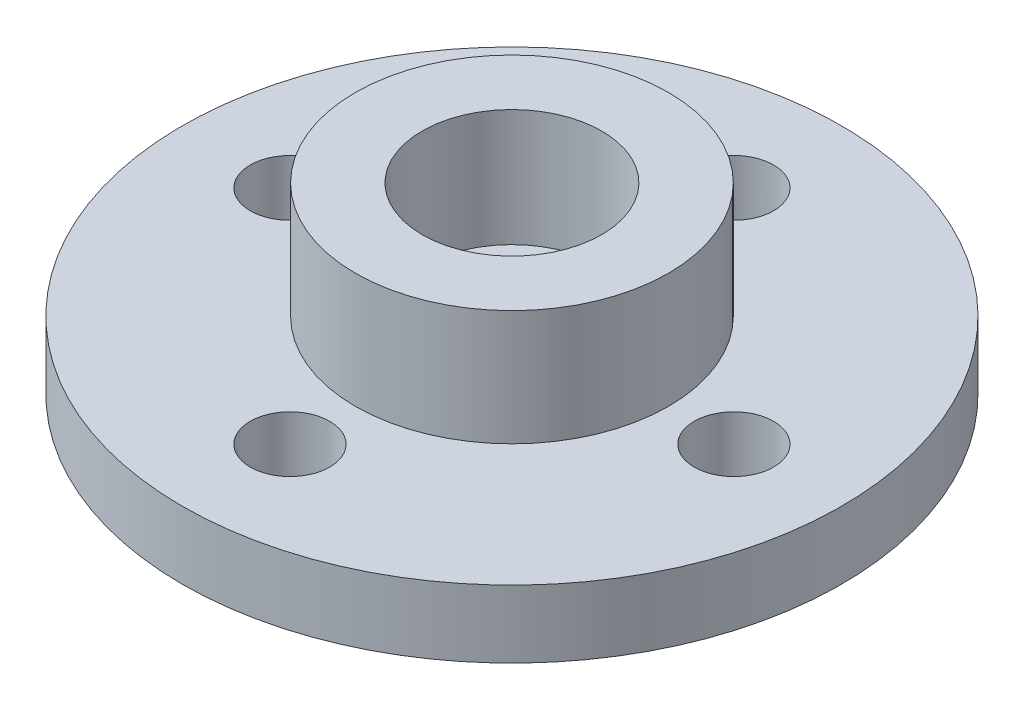
ISO-10303-21;
HEADER;
FILE_DESCRIPTION(('STEP AP214'),'2;1');
FILE_NAME('part.step','',(''),(''),'','','');
FILE_SCHEMA(('AUTOMOTIVE_DESIGN { 1 0 10303 214 1 1 1 1 }'));
ENDSEC;
DATA;
#1=APPLICATION_CONTEXT('core data for automotive mechanical design processes');
#2=APPLICATION_PROTOCOL_DEFINITION('international standard','automotive_design',2000,#1);
#3=PRODUCT_CONTEXT('',#1,'mechanical');
#4=PRODUCT('Part','Part','',(#3));
#5=PRODUCT_RELATED_PRODUCT_CATEGORY('part','',(#4));
#6=PRODUCT_DEFINITION_FORMATION('','',#4);
#7=PRODUCT_DEFINITION_CONTEXT('part definition',#1,'design');
#8=PRODUCT_DEFINITION('design','',#6,#7);
#9=PRODUCT_DEFINITION_SHAPE('','',#8);
#10=(LENGTH_UNIT() NAMED_UNIT(*) SI_UNIT(.MILLI.,.METRE.));
#11=(NAMED_UNIT(*) PLANE_ANGLE_UNIT() SI_UNIT($,.RADIAN.));
#12=(NAMED_UNIT(*) SI_UNIT($,.STERADIAN.) SOLID_ANGLE_UNIT());
#13=UNCERTAINTY_MEASURE_WITH_UNIT(LENGTH_MEASURE(1.E-05),#10,'distance_accuracy_value','');
#14=(GEOMETRIC_REPRESENTATION_CONTEXT(3) GLOBAL_UNCERTAINTY_ASSIGNED_CONTEXT((#13)) GLOBAL_UNIT_ASSIGNED_CONTEXT((#10,
#11,#12)) REPRESENTATION_CONTEXT('',''));
#15=CARTESIAN_POINT('',(0.,0.,0.));
#16=DIRECTION('',(0.,0.,1.));
#17=DIRECTION('',(1.,0.,0.));
#18=AXIS2_PLACEMENT_3D('',#15,#16,#17);
#19=CARTESIAN_POINT('',(0.,2.05,0.));
#20=DIRECTION('',(0.,-1.,0.));
#21=DIRECTION('',(0.,0.,-1.));
#22=AXIS2_PLACEMENT_3D('',#19,#20,#21);
#23=CYLINDRICAL_SURFACE('',#22,10.);
#24=CARTESIAN_POINT('',(0.,2.05,0.));
#25=DIRECTION('',(0.,1.,0.));
#26=DIRECTION('',(0.,0.,1.));
#27=AXIS2_PLACEMENT_3D('',#24,#25,#26);
#28=CIRCLE('',#27,10.);
#29=CARTESIAN_POINT('',(0.,2.05,10.));
#30=VERTEX_POINT('',#29);
#31=EDGE_CURVE('E12',#30,#30,#28,.T.);
#32=ORIENTED_EDGE('',*,*,#31,.F.);
#33=EDGE_LOOP('',(#32));
#34=FACE_BOUND('',#33,.T.);
#35=CARTESIAN_POINT('',(0.,0.,0.));
#36=DIRECTION('',(0.,1.,0.));
#37=DIRECTION('',(0.,0.,1.));
#38=AXIS2_PLACEMENT_3D('',#35,#36,#37);
#39=CIRCLE('',#38,10.);
#40=CARTESIAN_POINT('',(0.,0.,10.));
#41=VERTEX_POINT('',#40);
#42=EDGE_CURVE('E47',#41,#41,#39,.T.);
#43=ORIENTED_EDGE('',*,*,#42,.T.);
#44=EDGE_LOOP('',(#43));
#45=FACE_BOUND('',#44,.T.);
#46=ADVANCED_FACE('F44',(#34,#45),#23,.T.);
#47=CARTESIAN_POINT('',(0.,2.05,0.));
#48=DIRECTION('',(0.,1.,0.));
#49=DIRECTION('',(0.,0.,1.));
#50=AXIS2_PLACEMENT_3D('',#47,#48,#49);
#51=PLANE('',#50);
#52=CARTESIAN_POINT('',(6.735,2.05,0.));
#53=DIRECTION('',(0.,1.,0.));
#54=DIRECTION('',(0.,0.,1.));
#55=AXIS2_PLACEMENT_3D('',#52,#53,#54);
#56=CIRCLE('',#55,1.205);
#57=CARTESIAN_POINT('',(6.735,2.05,1.205));
#58=VERTEX_POINT('',#57);
#59=EDGE_CURVE('E85',#58,#58,#56,.T.);
#60=ORIENTED_EDGE('',*,*,#59,.F.);
#61=EDGE_LOOP('',(#60));
#62=FACE_BOUND('',#61,.T.);
#63=CARTESIAN_POINT('',(0.,2.05,-6.735));
#64=DIRECTION('',(0.,1.,0.));
#65=DIRECTION('',(0.,0.,1.));
#66=AXIS2_PLACEMENT_3D('',#63,#64,#65);
#67=CIRCLE('',#66,1.205);
#68=CARTESIAN_POINT('',(0.,2.05,-5.53));
#69=VERTEX_POINT('',#68);
#70=EDGE_CURVE('E88',#69,#69,#67,.T.);
#71=ORIENTED_EDGE('',*,*,#70,.F.);
#72=EDGE_LOOP('',(#71));
#73=FACE_BOUND('',#72,.T.);
#74=CARTESIAN_POINT('',(0.,2.05,6.735));
#75=DIRECTION('',(0.,1.,0.));
#76=DIRECTION('',(0.,0.,1.));
#77=AXIS2_PLACEMENT_3D('',#74,#75,#76);
#78=CIRCLE('',#77,1.205);
#79=CARTESIAN_POINT('',(0.,2.05,7.94));
#80=VERTEX_POINT('',#79);
#81=EDGE_CURVE('E79',#80,#80,#78,.T.);
#82=ORIENTED_EDGE('',*,*,#81,.F.);
#83=EDGE_LOOP('',(#82));
#84=FACE_BOUND('',#83,.T.);
#85=CARTESIAN_POINT('',(-6.735,2.05,0.));
#86=DIRECTION('',(0.,1.,0.));
#87=DIRECTION('',(0.,0.,1.));
#88=AXIS2_PLACEMENT_3D('',#85,#86,#87);
#89=CIRCLE('',#88,1.205);
#90=CARTESIAN_POINT('',(-6.735,2.05,1.205));
#91=VERTEX_POINT('',#90);
#92=EDGE_CURVE('E73',#91,#91,#89,.T.);
#93=ORIENTED_EDGE('',*,*,#92,.F.);
#94=EDGE_LOOP('',(#93));
#95=FACE_BOUND('',#94,.T.);
#96=CARTESIAN_POINT('',(0.,2.05,0.));
#97=DIRECTION('',(0.,1.,0.));
#98=DIRECTION('',(0.,0.,1.));
#99=AXIS2_PLACEMENT_3D('',#96,#97,#98);
#100=CIRCLE('',#99,4.75);
#101=CARTESIAN_POINT('',(0.,2.05,4.75));
#102=VERTEX_POINT('',#101);
#103=EDGE_CURVE('E56',#102,#102,#100,.T.);
#104=ORIENTED_EDGE('',*,*,#103,.F.);
#105=EDGE_LOOP('',(#104));
#106=FACE_BOUND('',#105,.T.);
#107=ORIENTED_EDGE('',*,*,#31,.T.);
#108=EDGE_LOOP('',(#107));
#109=FACE_BOUND('',#108,.T.);
#110=ADVANCED_FACE('F104',(#62,#73,#84,#95,#106,#109),#51,.T.);
#111=CARTESIAN_POINT('',(0.,0.,0.));
#112=DIRECTION('',(0.,1.,0.));
#113=DIRECTION('',(0.,0.,1.));
#114=AXIS2_PLACEMENT_3D('',#111,#112,#113);
#115=PLANE('',#114);
#116=CARTESIAN_POINT('',(6.735,0.,0.));
#117=DIRECTION('',(0.,-1.,0.));
#118=DIRECTION('',(0.,0.,1.));
#119=AXIS2_PLACEMENT_3D('',#116,#117,#118);
#120=CIRCLE('',#119,1.205);
#121=CARTESIAN_POINT('',(6.735,0.,1.205));
#122=VERTEX_POINT('',#121);
#123=EDGE_CURVE('E91',#122,#122,#120,.T.);
#124=ORIENTED_EDGE('',*,*,#123,.F.);
#125=EDGE_LOOP('',(#124));
#126=FACE_BOUND('',#125,.T.);
#127=CARTESIAN_POINT('',(0.,0.,-6.735));
#128=DIRECTION('',(0.,-1.,0.));
#129=DIRECTION('',(1.,0.,0.));
#130=AXIS2_PLACEMENT_3D('',#127,#128,#129);
#131=CIRCLE('',#130,1.205);
#132=CARTESIAN_POINT('',(1.20499999999993,0.,-6.73500000000001));
#133=VERTEX_POINT('',#132);
#134=EDGE_CURVE('E92',#133,#133,#131,.T.);
#135=ORIENTED_EDGE('',*,*,#134,.F.);
#136=EDGE_LOOP('',(#135));
#137=FACE_BOUND('',#136,.T.);
#138=CARTESIAN_POINT('',(0.,0.,6.735));
#139=DIRECTION('',(0.,-1.,0.));
#140=DIRECTION('',(-1.,0.,0.));
#141=AXIS2_PLACEMENT_3D('',#138,#139,#140);
#142=CIRCLE('',#141,1.205);
#143=CARTESIAN_POINT('',(-1.20499999999998,0.,6.73500000000001));
#144=VERTEX_POINT('',#143);
#145=EDGE_CURVE('E82',#144,#144,#142,.T.);
#146=ORIENTED_EDGE('',*,*,#145,.F.);
#147=EDGE_LOOP('',(#146));
#148=FACE_BOUND('',#147,.T.);
#149=CARTESIAN_POINT('',(-6.735,0.,0.));
#150=DIRECTION('',(0.,-1.,0.));
#151=DIRECTION('',(0.,0.,-1.));
#152=AXIS2_PLACEMENT_3D('',#149,#150,#151);
#153=CIRCLE('',#152,1.205);
#154=CARTESIAN_POINT('',(-6.735,0.,-1.205));
#155=VERTEX_POINT('',#154);
#156=EDGE_CURVE('E76',#155,#155,#153,.T.);
#157=ORIENTED_EDGE('',*,*,#156,.F.);
#158=EDGE_LOOP('',(#157));
#159=FACE_BOUND('',#158,.T.);
#160=CARTESIAN_POINT('',(0.,0.,0.));
#161=DIRECTION('',(0.,1.,0.));
#162=DIRECTION('',(0.,0.,1.));
#163=AXIS2_PLACEMENT_3D('',#160,#161,#162);
#164=CIRCLE('',#163,1.375);
#165=CARTESIAN_POINT('',(0.,0.,1.375));
#166=VERTEX_POINT('',#165);
#167=EDGE_CURVE('E65',#166,#166,#164,.T.);
#168=ORIENTED_EDGE('',*,*,#167,.T.);
#169=EDGE_LOOP('',(#168));
#170=FACE_BOUND('',#169,.T.);
#171=ORIENTED_EDGE('',*,*,#42,.F.);
#172=EDGE_LOOP('',(#171));
#173=FACE_BOUND('',#172,.T.);
#174=ADVANCED_FACE('F100',(#126,#137,#148,#159,#170,#173),#115,.F.);
#175=CARTESIAN_POINT('',(0.,5.55,0.));
#176=DIRECTION('',(0.,-1.,0.));
#177=DIRECTION('',(0.,0.,-1.));
#178=AXIS2_PLACEMENT_3D('',#175,#176,#177);
#179=CYLINDRICAL_SURFACE('',#178,4.75);
#180=CARTESIAN_POINT('',(0.,5.55,0.));
#181=DIRECTION('',(0.,1.,0.));
#182=DIRECTION('',(0.,0.,1.));
#183=AXIS2_PLACEMENT_3D('',#180,#181,#182);
#184=CIRCLE('',#183,4.75);
#185=CARTESIAN_POINT('',(0.,5.55,4.75));
#186=VERTEX_POINT('',#185);
#187=EDGE_CURVE('E54',#186,#186,#184,.T.);
#188=ORIENTED_EDGE('',*,*,#187,.F.);
#189=EDGE_LOOP('',(#188));
#190=FACE_BOUND('',#189,.T.);
#191=ORIENTED_EDGE('',*,*,#103,.T.);
#192=EDGE_LOOP('',(#191));
#193=FACE_BOUND('',#192,.T.);
#194=ADVANCED_FACE('F103',(#190,#193),#179,.T.);
#195=CARTESIAN_POINT('',(0.,5.55,0.));
#196=DIRECTION('',(0.,1.,0.));
#197=DIRECTION('',(0.,0.,1.));
#198=AXIS2_PLACEMENT_3D('',#195,#196,#197);
#199=PLANE('',#198);
#200=CARTESIAN_POINT('',(0.,5.55,0.));
#201=DIRECTION('',(0.,1.,0.));
#202=DIRECTION('',(0.,0.,1.));
#203=AXIS2_PLACEMENT_3D('',#200,#201,#202);
#204=CIRCLE('',#203,2.725);
#205=CARTESIAN_POINT('',(0.,5.55,2.725));
#206=VERTEX_POINT('',#205);
#207=EDGE_CURVE('E62',#206,#206,#204,.T.);
#208=ORIENTED_EDGE('',*,*,#207,.F.);
#209=EDGE_LOOP('',(#208));
#210=FACE_BOUND('',#209,.T.);
#211=ORIENTED_EDGE('',*,*,#187,.T.);
#212=EDGE_LOOP('',(#211));
#213=FACE_BOUND('',#212,.T.);
#214=ADVANCED_FACE('F129',(#210,#213),#199,.T.);
#215=CARTESIAN_POINT('',(0.,2.,0.));
#216=DIRECTION('',(0.,1.,0.));
#217=DIRECTION('',(0.,0.,1.));
#218=AXIS2_PLACEMENT_3D('',#215,#216,#217);
#219=CYLINDRICAL_SURFACE('',#218,2.725);
#220=CARTESIAN_POINT('',(0.,2.,0.));
#221=DIRECTION('',(0.,1.,0.));
#222=DIRECTION('',(0.,0.,1.));
#223=AXIS2_PLACEMENT_3D('',#220,#221,#222);
#224=CIRCLE('',#223,2.725);
#225=CARTESIAN_POINT('',(0.,2.,2.725));
#226=VERTEX_POINT('',#225);
#227=EDGE_CURVE('E59',#226,#226,#224,.T.);
#228=ORIENTED_EDGE('',*,*,#227,.F.);
#229=EDGE_LOOP('',(#228));
#230=FACE_BOUND('',#229,.T.);
#231=ORIENTED_EDGE('',*,*,#207,.T.);
#232=EDGE_LOOP('',(#231));
#233=FACE_BOUND('',#232,.T.);
#234=ADVANCED_FACE('F133',(#230,#233),#219,.F.);
#235=CARTESIAN_POINT('',(0.,2.,0.));
#236=DIRECTION('',(0.,1.,0.));
#237=DIRECTION('',(0.,0.,1.));
#238=AXIS2_PLACEMENT_3D('',#235,#236,#237);
#239=PLANE('',#238);
#240=CARTESIAN_POINT('',(0.,2.,0.));
#241=DIRECTION('',(0.,1.,0.));
#242=DIRECTION('',(0.,0.,1.));
#243=AXIS2_PLACEMENT_3D('',#240,#241,#242);
#244=CIRCLE('',#243,1.375);
#245=CARTESIAN_POINT('',(0.,2.,1.375));
#246=VERTEX_POINT('',#245);
#247=EDGE_CURVE('E70',#246,#246,#244,.T.);
#248=ORIENTED_EDGE('',*,*,#247,.F.);
#249=EDGE_LOOP('',(#248));
#250=FACE_BOUND('',#249,.T.);
#251=ORIENTED_EDGE('',*,*,#227,.T.);
#252=EDGE_LOOP('',(#251));
#253=FACE_BOUND('',#252,.T.);
#254=ADVANCED_FACE('F137',(#250,#253),#239,.T.);
#255=CARTESIAN_POINT('',(0.,-1.55,0.));
#256=DIRECTION('',(0.,1.,0.));
#257=DIRECTION('',(0.,0.,1.));
#258=AXIS2_PLACEMENT_3D('',#255,#256,#257);
#259=CYLINDRICAL_SURFACE('',#258,1.375);
#260=ORIENTED_EDGE('',*,*,#247,.T.);
#261=EDGE_LOOP('',(#260));
#262=FACE_BOUND('',#261,.T.);
#263=ORIENTED_EDGE('',*,*,#167,.F.);
#264=EDGE_LOOP('',(#263));
#265=FACE_BOUND('',#264,.T.);
#266=ADVANCED_FACE('F141',(#262,#265),#259,.F.);
#267=CARTESIAN_POINT('',(-6.735,3.55,0.));
#268=DIRECTION('',(0.,-1.,0.));
#269=DIRECTION('',(0.,0.,-1.));
#270=AXIS2_PLACEMENT_3D('',#267,#268,#269);
#271=CYLINDRICAL_SURFACE('',#270,1.205);
#272=ORIENTED_EDGE('',*,*,#92,.T.);
#273=EDGE_LOOP('',(#272));
#274=FACE_BOUND('',#273,.T.);
#275=ORIENTED_EDGE('',*,*,#156,.T.);
#276=EDGE_LOOP('',(#275));
#277=FACE_BOUND('',#276,.T.);
#278=ADVANCED_FACE('F145',(#274,#277),#271,.F.);
#279=CARTESIAN_POINT('',(0.,3.55,6.735));
#280=DIRECTION('',(0.,-1.,0.));
#281=DIRECTION('',(0.,0.,-1.));
#282=AXIS2_PLACEMENT_3D('',#279,#280,#281);
#283=CYLINDRICAL_SURFACE('',#282,1.205);
#284=ORIENTED_EDGE('',*,*,#81,.T.);
#285=EDGE_LOOP('',(#284));
#286=FACE_BOUND('',#285,.T.);
#287=ORIENTED_EDGE('',*,*,#145,.T.);
#288=EDGE_LOOP('',(#287));
#289=FACE_BOUND('',#288,.T.);
#290=ADVANCED_FACE('F149',(#286,#289),#283,.F.);
#291=CARTESIAN_POINT('',(0.,3.55,-6.735));
#292=DIRECTION('',(0.,-1.,0.));
#293=DIRECTION('',(0.,0.,-1.));
#294=AXIS2_PLACEMENT_3D('',#291,#292,#293);
#295=CYLINDRICAL_SURFACE('',#294,1.205);
#296=ORIENTED_EDGE('',*,*,#70,.T.);
#297=EDGE_LOOP('',(#296));
#298=FACE_BOUND('',#297,.T.);
#299=ORIENTED_EDGE('',*,*,#134,.T.);
#300=EDGE_LOOP('',(#299));
#301=FACE_BOUND('',#300,.T.);
#302=ADVANCED_FACE('F153',(#298,#301),#295,.F.);
#303=CARTESIAN_POINT('',(6.735,3.55,0.));
#304=DIRECTION('',(0.,-1.,0.));
#305=DIRECTION('',(0.,0.,-1.));
#306=AXIS2_PLACEMENT_3D('',#303,#304,#305);
#307=CYLINDRICAL_SURFACE('',#306,1.205);
#308=ORIENTED_EDGE('',*,*,#59,.T.);
#309=EDGE_LOOP('',(#308));
#310=FACE_BOUND('',#309,.T.);
#311=ORIENTED_EDGE('',*,*,#123,.T.);
#312=EDGE_LOOP('',(#311));
#313=FACE_BOUND('',#312,.T.);
#314=ADVANCED_FACE('F98',(#310,#313),#307,.F.);
#315=CLOSED_SHELL('',(#46,#110,#174,#194,#214,#234,#254,#266,#278,#290,#302,#314));
#316=MANIFOLD_SOLID_BREP('B2',#315);
#317=ADVANCED_BREP_SHAPE_REPRESENTATION('',(#18,#316),#14);
#318=SHAPE_DEFINITION_REPRESENTATION(#9,#317);
ENDSEC;
END-ISO-10303-21;
